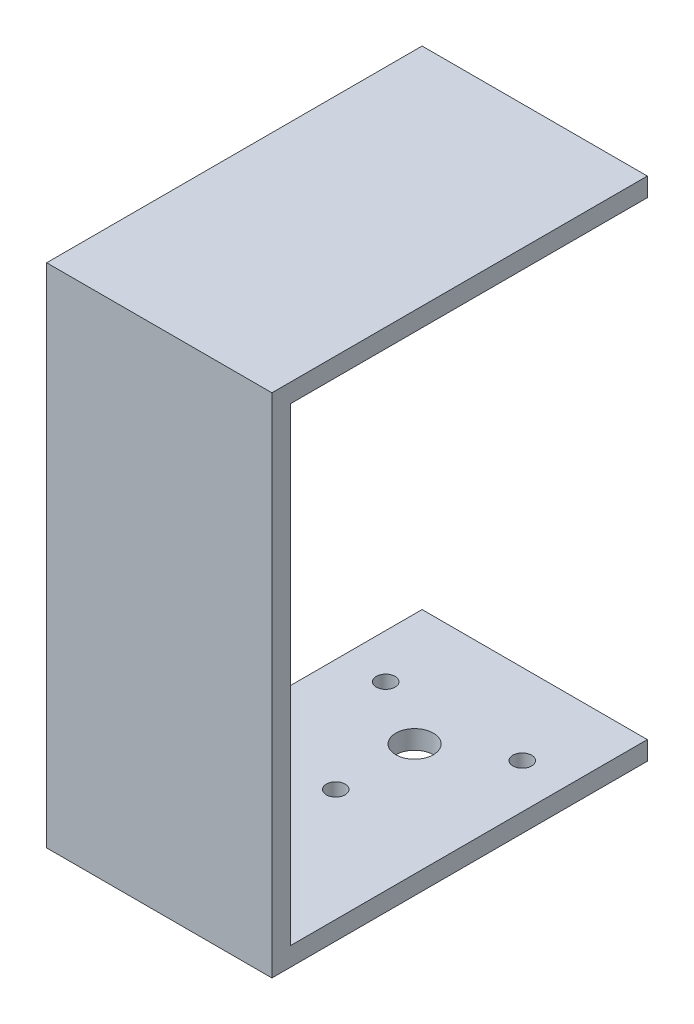
ISO-10303-21;
HEADER;
FILE_DESCRIPTION(('STEP AP214'),'2;1');
FILE_NAME('part.step','',(''),(''),'','','');
FILE_SCHEMA(('AUTOMOTIVE_DESIGN { 1 0 10303 214 1 1 1 1 }'));
ENDSEC;
DATA;
#1=APPLICATION_CONTEXT('core data for automotive mechanical design processes');
#2=APPLICATION_PROTOCOL_DEFINITION('international standard','automotive_design',2000,#1);
#3=PRODUCT_CONTEXT('',#1,'mechanical');
#4=PRODUCT('Part','Part','',(#3));
#5=PRODUCT_RELATED_PRODUCT_CATEGORY('part','',(#4));
#6=PRODUCT_DEFINITION_FORMATION('','',#4);
#7=PRODUCT_DEFINITION_CONTEXT('part definition',#1,'design');
#8=PRODUCT_DEFINITION('design','',#6,#7);
#9=PRODUCT_DEFINITION_SHAPE('','',#8);
#10=(LENGTH_UNIT() NAMED_UNIT(*) SI_UNIT(.MILLI.,.METRE.));
#11=(NAMED_UNIT(*) PLANE_ANGLE_UNIT() SI_UNIT($,.RADIAN.));
#12=(NAMED_UNIT(*) SI_UNIT($,.STERADIAN.) SOLID_ANGLE_UNIT());
#13=UNCERTAINTY_MEASURE_WITH_UNIT(LENGTH_MEASURE(1.E-05),#10,'distance_accuracy_value','');
#14=(GEOMETRIC_REPRESENTATION_CONTEXT(3) GLOBAL_UNCERTAINTY_ASSIGNED_CONTEXT((#13)) GLOBAL_UNIT_ASSIGNED_CONTEXT((#10,
#11,#12)) REPRESENTATION_CONTEXT('',''));
#15=CARTESIAN_POINT('',(0.,0.,0.));
#16=DIRECTION('',(0.,0.,1.));
#17=DIRECTION('',(1.,0.,0.));
#18=AXIS2_PLACEMENT_3D('',#15,#16,#17);
#19=CARTESIAN_POINT('',(-60.,135.,-4.99999999999999));
#20=DIRECTION('',(0.,0.,1.));
#21=DIRECTION('',(1.,0.,0.));
#22=AXIS2_PLACEMENT_3D('',#19,#20,#21);
#23=PLANE('',#22);
#24=DIRECTION('',(-1.,0.,0.));
#25=VECTOR('',#24,1.);
#26=CARTESIAN_POINT('',(0.,130.,-4.99999999999999));
#27=LINE('',#26,#25);
#28=CARTESIAN_POINT('',(0.,130.,-4.99999999999999));
#29=VERTEX_POINT('',#28);
#30=CARTESIAN_POINT('',(-60.,130.,-4.99999999999999));
#31=VERTEX_POINT('',#30);
#32=EDGE_CURVE('E141',#29,#31,#27,.T.);
#33=ORIENTED_EDGE('',*,*,#32,.F.);
#34=DIRECTION('',(0.,-1.,0.));
#35=VECTOR('',#34,1.);
#36=CARTESIAN_POINT('',(0.,135.,-4.99999999999999));
#37=LINE('',#36,#35);
#38=CARTESIAN_POINT('',(0.,5.,-5.00000000000002));
#39=VERTEX_POINT('',#38);
#40=EDGE_CURVE('E47',#29,#39,#37,.T.);
#41=ORIENTED_EDGE('',*,*,#40,.T.);
#42=DIRECTION('',(-1.,0.,0.));
#43=VECTOR('',#42,1.);
#44=CARTESIAN_POINT('',(-60.,5.,-4.99999999999999));
#45=LINE('',#44,#43);
#46=CARTESIAN_POINT('',(-60.,5.,-4.99999999999999));
#47=VERTEX_POINT('',#46);
#48=EDGE_CURVE('E148',#39,#47,#45,.T.);
#49=ORIENTED_EDGE('',*,*,#48,.T.);
#50=DIRECTION('',(0.,-1.,0.));
#51=VECTOR('',#50,1.);
#52=CARTESIAN_POINT('',(-60.,135.,-4.99999999999999));
#53=LINE('',#52,#51);
#54=EDGE_CURVE('E157',#31,#47,#53,.T.);
#55=ORIENTED_EDGE('',*,*,#54,.F.);
#56=EDGE_LOOP('',(#33,#41,#49,#55));
#57=FACE_BOUND('',#56,.T.);
#58=ADVANCED_FACE('F32',(#57),#23,.F.);
#59=CARTESIAN_POINT('',(0.,5.,0.));
#60=DIRECTION('',(0.,-1.,0.));
#61=DIRECTION('',(0.,0.,-1.));
#62=AXIS2_PLACEMENT_3D('',#59,#60,#61);
#63=PLANE('',#62);
#64=CARTESIAN_POINT('',(-30.,5.,-47.));
#65=DIRECTION('',(0.,-1.,0.));
#66=DIRECTION('',(0.,0.,-1.));
#67=AXIS2_PLACEMENT_3D('',#64,#65,#66);
#68=CIRCLE('',#67,2.5);
#69=CARTESIAN_POINT('',(-30.,5.,-49.5));
#70=VERTEX_POINT('',#69);
#71=EDGE_CURVE('E353',#70,#70,#68,.T.);
#72=ORIENTED_EDGE('',*,*,#71,.T.);
#73=EDGE_LOOP('',(#72));
#74=FACE_BOUND('',#73,.T.);
#75=CARTESIAN_POINT('',(-48.1865334794732,5.,-78.4999999999999));
#76=DIRECTION('',(0.,-1.,0.));
#77=DIRECTION('',(0.,0.,-1.));
#78=AXIS2_PLACEMENT_3D('',#75,#76,#77);
#79=CIRCLE('',#78,2.5);
#80=CARTESIAN_POINT('',(-48.1865334794732,5.,-80.9999999999999));
#81=VERTEX_POINT('',#80);
#82=EDGE_CURVE('E354',#81,#81,#79,.T.);
#83=ORIENTED_EDGE('',*,*,#82,.T.);
#84=EDGE_LOOP('',(#83));
#85=FACE_BOUND('',#84,.T.);
#86=CARTESIAN_POINT('',(-11.8134665205267,5.,-78.4999999999999));
#87=DIRECTION('',(0.,-1.,0.));
#88=DIRECTION('',(0.,0.,-1.));
#89=AXIS2_PLACEMENT_3D('',#86,#87,#88);
#90=CIRCLE('',#89,2.50000000000001);
#91=CARTESIAN_POINT('',(-11.8134665205267,5.,-80.9999999999999));
#92=VERTEX_POINT('',#91);
#93=EDGE_CURVE('E358',#92,#92,#90,.T.);
#94=ORIENTED_EDGE('',*,*,#93,.T.);
#95=EDGE_LOOP('',(#94));
#96=FACE_BOUND('',#95,.T.);
#97=CARTESIAN_POINT('',(-30.,5.,-68.));
#98=DIRECTION('',(0.,-1.,0.));
#99=DIRECTION('',(0.,0.,-1.));
#100=AXIS2_PLACEMENT_3D('',#97,#98,#99);
#101=CIRCLE('',#100,5.00000000000001);
#102=CARTESIAN_POINT('',(-30.,5.,-73.));
#103=VERTEX_POINT('',#102);
#104=EDGE_CURVE('E120',#103,#103,#101,.T.);
#105=ORIENTED_EDGE('',*,*,#104,.T.);
#106=EDGE_LOOP('',(#105));
#107=FACE_BOUND('',#106,.T.);
#108=DIRECTION('',(0.,0.,-1.));
#109=VECTOR('',#108,1.);
#110=CARTESIAN_POINT('',(0.,5.,-100.));
#111=LINE('',#110,#109);
#112=CARTESIAN_POINT('',(0.,5.,-100.));
#113=VERTEX_POINT('',#112);
#114=EDGE_CURVE('E162',#39,#113,#111,.T.);
#115=ORIENTED_EDGE('',*,*,#114,.T.);
#116=DIRECTION('',(1.,0.,0.));
#117=VECTOR('',#116,1.);
#118=CARTESIAN_POINT('',(0.,5.,-100.));
#119=LINE('',#118,#117);
#120=CARTESIAN_POINT('',(-60.,5.,-100.));
#121=VERTEX_POINT('',#120);
#122=EDGE_CURVE('E119',#121,#113,#119,.T.);
#123=ORIENTED_EDGE('',*,*,#122,.F.);
#124=DIRECTION('',(0.,0.,1.));
#125=VECTOR('',#124,1.);
#126=CARTESIAN_POINT('',(-60.,5.,0.));
#127=LINE('',#126,#125);
#128=EDGE_CURVE('E164',#121,#47,#127,.T.);
#129=ORIENTED_EDGE('',*,*,#128,.T.);
#130=ORIENTED_EDGE('',*,*,#48,.F.);
#131=EDGE_LOOP('',(#115,#123,#129,#130));
#132=FACE_BOUND('',#131,.T.);
#133=ADVANCED_FACE('F183',(#74,#85,#96,#107,#132),#63,.F.);
#134=CARTESIAN_POINT('',(0.,5.,-100.));
#135=DIRECTION('',(-1.,0.,0.));
#136=DIRECTION('',(0.,0.,1.));
#137=AXIS2_PLACEMENT_3D('',#134,#135,#136);
#138=PLANE('',#137);
#139=DIRECTION('',(0.,0.,-1.));
#140=VECTOR('',#139,1.);
#141=CARTESIAN_POINT('',(0.,0.,-100.));
#142=LINE('',#141,#140);
#143=CARTESIAN_POINT('',(0.,0.,0.));
#144=VERTEX_POINT('',#143);
#145=CARTESIAN_POINT('',(0.,0.,-100.));
#146=VERTEX_POINT('',#145);
#147=EDGE_CURVE('E99',#144,#146,#142,.T.);
#148=ORIENTED_EDGE('',*,*,#147,.T.);
#149=DIRECTION('',(0.,-1.,0.));
#150=VECTOR('',#149,1.);
#151=CARTESIAN_POINT('',(0.,5.,-100.));
#152=LINE('',#151,#150);
#153=EDGE_CURVE('E103',#113,#146,#152,.T.);
#154=ORIENTED_EDGE('',*,*,#153,.F.);
#155=ORIENTED_EDGE('',*,*,#114,.F.);
#156=ORIENTED_EDGE('',*,*,#40,.F.);
#157=DIRECTION('',(0.,0.,1.));
#158=VECTOR('',#157,1.);
#159=CARTESIAN_POINT('',(0.,130.,-60.));
#160=LINE('',#159,#158);
#161=CARTESIAN_POINT('',(0.,130.,-100.));
#162=VERTEX_POINT('',#161);
#163=EDGE_CURVE('E146',#162,#29,#160,.T.);
#164=ORIENTED_EDGE('',*,*,#163,.F.);
#165=DIRECTION('',(0.,-1.,0.));
#166=VECTOR('',#165,1.);
#167=CARTESIAN_POINT('',(0.,135.,-100.));
#168=LINE('',#167,#166);
#169=CARTESIAN_POINT('',(0.,135.,-100.));
#170=VERTEX_POINT('',#169);
#171=EDGE_CURVE('E129',#170,#162,#168,.T.);
#172=ORIENTED_EDGE('',*,*,#171,.F.);
#173=DIRECTION('',(0.,0.,-1.));
#174=VECTOR('',#173,1.);
#175=CARTESIAN_POINT('',(0.,135.,0.));
#176=LINE('',#175,#174);
#177=CARTESIAN_POINT('',(0.,135.,0.));
#178=VERTEX_POINT('',#177);
#179=EDGE_CURVE('E155',#178,#170,#176,.T.);
#180=ORIENTED_EDGE('',*,*,#179,.F.);
#181=DIRECTION('',(0.,-1.,0.));
#182=VECTOR('',#181,1.);
#183=CARTESIAN_POINT('',(0.,5.,0.));
#184=LINE('',#183,#182);
#185=EDGE_CURVE('E40',#178,#144,#184,.T.);
#186=ORIENTED_EDGE('',*,*,#185,.T.);
#187=EDGE_LOOP('',(#148,#154,#155,#156,#164,#172,#180,#186));
#188=FACE_BOUND('',#187,.T.);
#189=ADVANCED_FACE('F34',(#188),#138,.F.);
#190=CARTESIAN_POINT('',(-60.,5.,0.));
#191=DIRECTION('',(1.,0.,0.));
#192=DIRECTION('',(0.,0.,-1.));
#193=AXIS2_PLACEMENT_3D('',#190,#191,#192);
#194=PLANE('',#193);
#195=ORIENTED_EDGE('',*,*,#128,.F.);
#196=DIRECTION('',(0.,1.,0.));
#197=VECTOR('',#196,1.);
#198=CARTESIAN_POINT('',(-60.,5.,-100.));
#199=LINE('',#198,#197);
#200=CARTESIAN_POINT('',(-60.,0.,-100.));
#201=VERTEX_POINT('',#200);
#202=EDGE_CURVE('E114',#201,#121,#199,.T.);
#203=ORIENTED_EDGE('',*,*,#202,.F.);
#204=DIRECTION('',(0.,0.,1.));
#205=VECTOR('',#204,1.);
#206=CARTESIAN_POINT('',(-60.,0.,0.));
#207=LINE('',#206,#205);
#208=CARTESIAN_POINT('',(-60.,0.,0.));
#209=VERTEX_POINT('',#208);
#210=EDGE_CURVE('E106',#201,#209,#207,.T.);
#211=ORIENTED_EDGE('',*,*,#210,.T.);
#212=DIRECTION('',(0.,-1.,0.));
#213=VECTOR('',#212,1.);
#214=CARTESIAN_POINT('',(-60.,5.,0.));
#215=LINE('',#214,#213);
#216=CARTESIAN_POINT('',(-60.,135.,0.));
#217=VERTEX_POINT('',#216);
#218=EDGE_CURVE('E11',#217,#209,#215,.T.);
#219=ORIENTED_EDGE('',*,*,#218,.F.);
#220=DIRECTION('',(0.,0.,1.));
#221=VECTOR('',#220,1.);
#222=CARTESIAN_POINT('',(-60.,135.,0.));
#223=LINE('',#222,#221);
#224=CARTESIAN_POINT('',(-60.,135.,-100.));
#225=VERTEX_POINT('',#224);
#226=EDGE_CURVE('E149',#225,#217,#223,.T.);
#227=ORIENTED_EDGE('',*,*,#226,.F.);
#228=DIRECTION('',(0.,1.,0.));
#229=VECTOR('',#228,1.);
#230=CARTESIAN_POINT('',(-60.,135.,-100.));
#231=LINE('',#230,#229);
#232=CARTESIAN_POINT('',(-60.,130.,-100.));
#233=VERTEX_POINT('',#232);
#234=EDGE_CURVE('E135',#233,#225,#231,.T.);
#235=ORIENTED_EDGE('',*,*,#234,.F.);
#236=DIRECTION('',(0.,0.,1.));
#237=VECTOR('',#236,1.);
#238=CARTESIAN_POINT('',(-60.,130.,-60.));
#239=LINE('',#238,#237);
#240=EDGE_CURVE('E143',#233,#31,#239,.T.);
#241=ORIENTED_EDGE('',*,*,#240,.T.);
#242=ORIENTED_EDGE('',*,*,#54,.T.);
#243=EDGE_LOOP('',(#195,#203,#211,#219,#227,#235,#241,#242));
#244=FACE_BOUND('',#243,.T.);
#245=ADVANCED_FACE('F168',(#244),#194,.F.);
#246=CARTESIAN_POINT('',(0.,5.,0.));
#247=DIRECTION('',(0.,0.,-1.));
#248=DIRECTION('',(-1.,0.,0.));
#249=AXIS2_PLACEMENT_3D('',#246,#247,#248);
#250=PLANE('',#249);
#251=DIRECTION('',(1.,0.,0.));
#252=VECTOR('',#251,1.);
#253=CARTESIAN_POINT('',(0.,0.,0.));
#254=LINE('',#253,#252);
#255=EDGE_CURVE('E54',#209,#144,#254,.T.);
#256=ORIENTED_EDGE('',*,*,#255,.T.);
#257=ORIENTED_EDGE('',*,*,#185,.F.);
#258=DIRECTION('',(1.,0.,0.));
#259=VECTOR('',#258,1.);
#260=CARTESIAN_POINT('',(-60.,135.,0.));
#261=LINE('',#260,#259);
#262=EDGE_CURVE('E152',#217,#178,#261,.T.);
#263=ORIENTED_EDGE('',*,*,#262,.F.);
#264=ORIENTED_EDGE('',*,*,#218,.T.);
#265=EDGE_LOOP('',(#256,#257,#263,#264));
#266=FACE_BOUND('',#265,.T.);
#267=ADVANCED_FACE('F170',(#266),#250,.F.);
#268=CARTESIAN_POINT('',(0.,0.,0.));
#269=DIRECTION('',(0.,-1.,0.));
#270=DIRECTION('',(0.,0.,-1.));
#271=AXIS2_PLACEMENT_3D('',#268,#269,#270);
#272=PLANE('',#271);
#273=CARTESIAN_POINT('',(-30.,0.,-47.));
#274=DIRECTION('',(0.,-1.,0.));
#275=DIRECTION('',(0.,0.,-1.));
#276=AXIS2_PLACEMENT_3D('',#273,#274,#275);
#277=CIRCLE('',#276,2.5);
#278=CARTESIAN_POINT('',(-30.,0.,-49.5));
#279=VERTEX_POINT('',#278);
#280=EDGE_CURVE('E351',#279,#279,#277,.T.);
#281=ORIENTED_EDGE('',*,*,#280,.F.);
#282=EDGE_LOOP('',(#281));
#283=FACE_BOUND('',#282,.T.);
#284=CARTESIAN_POINT('',(-48.1865334794732,0.,-78.4999999999999));
#285=DIRECTION('',(0.,-1.,0.));
#286=DIRECTION('',(0.,0.,-1.));
#287=AXIS2_PLACEMENT_3D('',#284,#285,#286);
#288=CIRCLE('',#287,2.5);
#289=CARTESIAN_POINT('',(-48.1865334794732,0.,-80.9999999999999));
#290=VERTEX_POINT('',#289);
#291=EDGE_CURVE('E366',#290,#290,#288,.T.);
#292=ORIENTED_EDGE('',*,*,#291,.F.);
#293=EDGE_LOOP('',(#292));
#294=FACE_BOUND('',#293,.T.);
#295=CARTESIAN_POINT('',(-11.8134665205267,0.,-78.4999999999999));
#296=DIRECTION('',(0.,-1.,0.));
#297=DIRECTION('',(0.,0.,-1.));
#298=AXIS2_PLACEMENT_3D('',#295,#296,#297);
#299=CIRCLE('',#298,2.50000000000001);
#300=CARTESIAN_POINT('',(-11.8134665205267,0.,-80.9999999999999));
#301=VERTEX_POINT('',#300);
#302=EDGE_CURVE('E363',#301,#301,#299,.T.);
#303=ORIENTED_EDGE('',*,*,#302,.F.);
#304=EDGE_LOOP('',(#303));
#305=FACE_BOUND('',#304,.T.);
#306=CARTESIAN_POINT('',(-30.,0.,-68.));
#307=DIRECTION('',(0.,-1.,0.));
#308=DIRECTION('',(0.,0.,-1.));
#309=AXIS2_PLACEMENT_3D('',#306,#307,#308);
#310=CIRCLE('',#309,5.00000000000001);
#311=CARTESIAN_POINT('',(-30.,0.,-73.));
#312=VERTEX_POINT('',#311);
#313=EDGE_CURVE('E123',#312,#312,#310,.T.);
#314=ORIENTED_EDGE('',*,*,#313,.F.);
#315=EDGE_LOOP('',(#314));
#316=FACE_BOUND('',#315,.T.);
#317=ORIENTED_EDGE('',*,*,#210,.F.);
#318=DIRECTION('',(-1.,0.,0.));
#319=VECTOR('',#318,1.);
#320=CARTESIAN_POINT('',(0.,0.,-100.));
#321=LINE('',#320,#319);
#322=EDGE_CURVE('E109',#146,#201,#321,.T.);
#323=ORIENTED_EDGE('',*,*,#322,.F.);
#324=ORIENTED_EDGE('',*,*,#147,.F.);
#325=ORIENTED_EDGE('',*,*,#255,.F.);
#326=EDGE_LOOP('',(#317,#323,#324,#325));
#327=FACE_BOUND('',#326,.T.);
#328=ADVANCED_FACE('F110',(#283,#294,#305,#316,#327),#272,.T.);
#329=CARTESIAN_POINT('',(0.,135.,0.));
#330=DIRECTION('',(0.,-1.,0.));
#331=DIRECTION('',(0.,0.,-1.));
#332=AXIS2_PLACEMENT_3D('',#329,#330,#331);
#333=PLANE('',#332);
#334=ORIENTED_EDGE('',*,*,#226,.T.);
#335=ORIENTED_EDGE('',*,*,#262,.T.);
#336=ORIENTED_EDGE('',*,*,#179,.T.);
#337=DIRECTION('',(1.,0.,0.));
#338=VECTOR('',#337,1.);
#339=CARTESIAN_POINT('',(0.,135.,-100.));
#340=LINE('',#339,#338);
#341=EDGE_CURVE('E138',#225,#170,#340,.T.);
#342=ORIENTED_EDGE('',*,*,#341,.F.);
#343=EDGE_LOOP('',(#334,#335,#336,#342));
#344=FACE_BOUND('',#343,.T.);
#345=ADVANCED_FACE('F173',(#344),#333,.F.);
#346=CARTESIAN_POINT('',(0.,130.,-60.));
#347=DIRECTION('',(0.,1.,0.));
#348=DIRECTION('',(0.,0.,1.));
#349=AXIS2_PLACEMENT_3D('',#346,#347,#348);
#350=PLANE('',#349);
#351=ORIENTED_EDGE('',*,*,#32,.T.);
#352=ORIENTED_EDGE('',*,*,#240,.F.);
#353=DIRECTION('',(-1.,0.,0.));
#354=VECTOR('',#353,1.);
#355=CARTESIAN_POINT('',(0.,130.,-100.));
#356=LINE('',#355,#354);
#357=EDGE_CURVE('E132',#162,#233,#356,.T.);
#358=ORIENTED_EDGE('',*,*,#357,.F.);
#359=ORIENTED_EDGE('',*,*,#163,.T.);
#360=EDGE_LOOP('',(#351,#352,#358,#359));
#361=FACE_BOUND('',#360,.T.);
#362=ADVANCED_FACE('F180',(#361),#350,.F.);
#363=CARTESIAN_POINT('',(0.,0.,-100.));
#364=DIRECTION('',(0.,0.,-1.));
#365=DIRECTION('',(-1.,0.,0.));
#366=AXIS2_PLACEMENT_3D('',#363,#364,#365);
#367=PLANE('',#366);
#368=ORIENTED_EDGE('',*,*,#171,.T.);
#369=ORIENTED_EDGE('',*,*,#357,.T.);
#370=ORIENTED_EDGE('',*,*,#234,.T.);
#371=ORIENTED_EDGE('',*,*,#341,.T.);
#372=EDGE_LOOP('',(#368,#369,#370,#371));
#373=FACE_BOUND('',#372,.T.);
#374=ADVANCED_FACE('F176',(#373),#367,.T.);
#375=CARTESIAN_POINT('',(0.,0.,-100.));
#376=DIRECTION('',(0.,0.,-1.));
#377=DIRECTION('',(-1.,0.,0.));
#378=AXIS2_PLACEMENT_3D('',#375,#376,#377);
#379=PLANE('',#378);
#380=ORIENTED_EDGE('',*,*,#153,.T.);
#381=ORIENTED_EDGE('',*,*,#322,.T.);
#382=ORIENTED_EDGE('',*,*,#202,.T.);
#383=ORIENTED_EDGE('',*,*,#122,.T.);
#384=EDGE_LOOP('',(#380,#381,#382,#383));
#385=FACE_BOUND('',#384,.T.);
#386=ADVANCED_FACE('F117',(#385),#379,.T.);
#387=CARTESIAN_POINT('',(-30.,40.,-68.));
#388=DIRECTION('',(0.,-1.,0.));
#389=DIRECTION('',(0.,0.,-1.));
#390=AXIS2_PLACEMENT_3D('',#387,#388,#389);
#391=CYLINDRICAL_SURFACE('',#390,5.00000000000001);
#392=ORIENTED_EDGE('',*,*,#313,.T.);
#393=EDGE_LOOP('',(#392));
#394=FACE_BOUND('',#393,.T.);
#395=ORIENTED_EDGE('',*,*,#104,.F.);
#396=EDGE_LOOP('',(#395));
#397=FACE_BOUND('',#396,.T.);
#398=ADVANCED_FACE('F238',(#394,#397),#391,.F.);
#399=CARTESIAN_POINT('',(-11.8134665205267,40.,-78.4999999999999));
#400=DIRECTION('',(0.,-1.,0.));
#401=DIRECTION('',(0.,0.,-1.));
#402=AXIS2_PLACEMENT_3D('',#399,#400,#401);
#403=CYLINDRICAL_SURFACE('',#402,2.50000000000001);
#404=ORIENTED_EDGE('',*,*,#302,.T.);
#405=EDGE_LOOP('',(#404));
#406=FACE_BOUND('',#405,.T.);
#407=ORIENTED_EDGE('',*,*,#93,.F.);
#408=EDGE_LOOP('',(#407));
#409=FACE_BOUND('',#408,.T.);
#410=ADVANCED_FACE('F245',(#406,#409),#403,.F.);
#411=CARTESIAN_POINT('',(-48.1865334794732,40.,-78.4999999999999));
#412=DIRECTION('',(0.,-1.,0.));
#413=DIRECTION('',(0.,0.,-1.));
#414=AXIS2_PLACEMENT_3D('',#411,#412,#413);
#415=CYLINDRICAL_SURFACE('',#414,2.5);
#416=ORIENTED_EDGE('',*,*,#291,.T.);
#417=EDGE_LOOP('',(#416));
#418=FACE_BOUND('',#417,.T.);
#419=ORIENTED_EDGE('',*,*,#82,.F.);
#420=EDGE_LOOP('',(#419));
#421=FACE_BOUND('',#420,.T.);
#422=ADVANCED_FACE('F252',(#418,#421),#415,.F.);
#423=CARTESIAN_POINT('',(-30.,40.,-47.));
#424=DIRECTION('',(0.,-1.,0.));
#425=DIRECTION('',(0.,0.,-1.));
#426=AXIS2_PLACEMENT_3D('',#423,#424,#425);
#427=CYLINDRICAL_SURFACE('',#426,2.5);
#428=ORIENTED_EDGE('',*,*,#280,.T.);
#429=EDGE_LOOP('',(#428));
#430=FACE_BOUND('',#429,.T.);
#431=ORIENTED_EDGE('',*,*,#71,.F.);
#432=EDGE_LOOP('',(#431));
#433=FACE_BOUND('',#432,.T.);
#434=ADVANCED_FACE('F260',(#430,#433),#427,.F.);
#435=CLOSED_SHELL('',(#58,#133,#189,#245,#267,#328,#345,#362,#374,#386,#398,#410,#422,#434));
#436=MANIFOLD_SOLID_BREP('B2',#435);
#437=ADVANCED_BREP_SHAPE_REPRESENTATION('',(#18,#436),#14);
#438=SHAPE_DEFINITION_REPRESENTATION(#9,#437);
ENDSEC;
END-ISO-10303-21;
